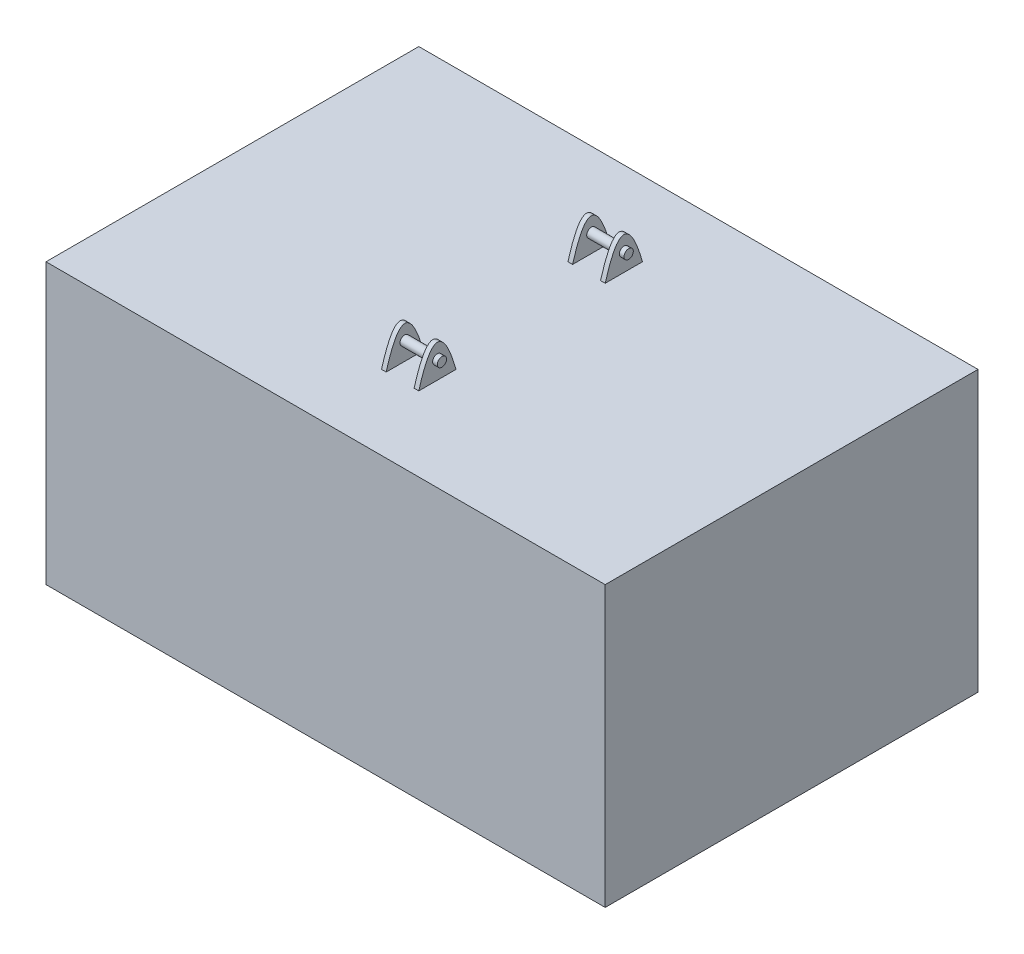
ISO-10303-21;
HEADER;
FILE_DESCRIPTION(('STEP AP214'),'2;1');
FILE_NAME('part.step','',(''),(''),'','','');
FILE_SCHEMA(('AUTOMOTIVE_DESIGN { 1 0 10303 214 1 1 1 1 }'));
ENDSEC;
DATA;
#1=APPLICATION_CONTEXT('core data for automotive mechanical design processes');
#2=APPLICATION_PROTOCOL_DEFINITION('international standard','automotive_design',2000,#1);
#3=PRODUCT_CONTEXT('',#1,'mechanical');
#4=PRODUCT('Part','Part','',(#3));
#5=PRODUCT_RELATED_PRODUCT_CATEGORY('part','',(#4));
#6=PRODUCT_DEFINITION_FORMATION('','',#4);
#7=PRODUCT_DEFINITION_CONTEXT('part definition',#1,'design');
#8=PRODUCT_DEFINITION('design','',#6,#7);
#9=PRODUCT_DEFINITION_SHAPE('','',#8);
#10=(LENGTH_UNIT() NAMED_UNIT(*) SI_UNIT(.MILLI.,.METRE.));
#11=(NAMED_UNIT(*) PLANE_ANGLE_UNIT() SI_UNIT($,.RADIAN.));
#12=(NAMED_UNIT(*) SI_UNIT($,.STERADIAN.) SOLID_ANGLE_UNIT());
#13=UNCERTAINTY_MEASURE_WITH_UNIT(LENGTH_MEASURE(1.E-05),#10,'distance_accuracy_value','');
#14=(GEOMETRIC_REPRESENTATION_CONTEXT(3) GLOBAL_UNCERTAINTY_ASSIGNED_CONTEXT((#13)) GLOBAL_UNIT_ASSIGNED_CONTEXT((#10,
#11,#12)) REPRESENTATION_CONTEXT('',''));
#15=CARTESIAN_POINT('',(0.,0.,0.));
#16=DIRECTION('',(0.,0.,1.));
#17=DIRECTION('',(1.,0.,0.));
#18=AXIS2_PLACEMENT_3D('',#15,#16,#17);
#19=CARTESIAN_POINT('',(-300.,150.,200.));
#20=DIRECTION('',(0.,1.,0.));
#21=DIRECTION('',(0.,0.,1.));
#22=AXIS2_PLACEMENT_3D('',#19,#20,#21);
#23=PLANE('',#22);
#24=DIRECTION('',(1.,0.,0.));
#25=VECTOR('',#24,1.);
#26=CARTESIAN_POINT('',(15.,150.,-80.));
#27=LINE('',#26,#25);
#28=CARTESIAN_POINT('',(15.,150.,-80.));
#29=VERTEX_POINT('',#28);
#30=CARTESIAN_POINT('',(20.,150.,-80.));
#31=VERTEX_POINT('',#30);
#32=EDGE_CURVE('E299',#29,#31,#27,.T.);
#33=ORIENTED_EDGE('',*,*,#32,.F.);
#34=DIRECTION('',(0.,0.,1.));
#35=VECTOR('',#34,1.);
#36=CARTESIAN_POINT('',(15.,150.,-80.));
#37=LINE('',#36,#35);
#38=CARTESIAN_POINT('',(15.,150.,-120.));
#39=VERTEX_POINT('',#38);
#40=EDGE_CURVE('E169',#39,#29,#37,.T.);
#41=ORIENTED_EDGE('',*,*,#40,.F.);
#42=DIRECTION('',(1.,0.,0.));
#43=VECTOR('',#42,1.);
#44=CARTESIAN_POINT('',(15.,150.,-120.));
#45=LINE('',#44,#43);
#46=CARTESIAN_POINT('',(20.,150.,-120.));
#47=VERTEX_POINT('',#46);
#48=EDGE_CURVE('E324',#39,#47,#45,.T.);
#49=ORIENTED_EDGE('',*,*,#48,.T.);
#50=DIRECTION('',(0.,0.,1.));
#51=VECTOR('',#50,1.);
#52=CARTESIAN_POINT('',(20.,150.,-100.));
#53=LINE('',#52,#51);
#54=EDGE_CURVE('E170',#47,#31,#53,.T.);
#55=ORIENTED_EDGE('',*,*,#54,.T.);
#56=EDGE_LOOP('',(#33,#41,#49,#55));
#57=FACE_BOUND('',#56,.T.);
#58=DIRECTION('',(1.,0.,0.));
#59=VECTOR('',#58,1.);
#60=CARTESIAN_POINT('',(15.,150.,120.));
#61=LINE('',#60,#59);
#62=CARTESIAN_POINT('',(15.,150.,120.));
#63=VERTEX_POINT('',#62);
#64=CARTESIAN_POINT('',(20.,150.,120.));
#65=VERTEX_POINT('',#64);
#66=EDGE_CURVE('E303',#63,#65,#61,.T.);
#67=ORIENTED_EDGE('',*,*,#66,.F.);
#68=DIRECTION('',(0.,0.,-1.));
#69=VECTOR('',#68,1.);
#70=CARTESIAN_POINT('',(15.,150.,100.));
#71=LINE('',#70,#69);
#72=CARTESIAN_POINT('',(15.,150.,80.));
#73=VERTEX_POINT('',#72);
#74=EDGE_CURVE('E260',#63,#73,#71,.T.);
#75=ORIENTED_EDGE('',*,*,#74,.T.);
#76=DIRECTION('',(1.,0.,0.));
#77=VECTOR('',#76,1.);
#78=CARTESIAN_POINT('',(15.,150.,80.));
#79=LINE('',#78,#77);
#80=CARTESIAN_POINT('',(20.,150.,80.));
#81=VERTEX_POINT('',#80);
#82=EDGE_CURVE('E610',#73,#81,#79,.T.);
#83=ORIENTED_EDGE('',*,*,#82,.T.);
#84=DIRECTION('',(0.,0.,-1.));
#85=VECTOR('',#84,1.);
#86=CARTESIAN_POINT('',(20.,150.,80.));
#87=LINE('',#86,#85);
#88=EDGE_CURVE('E261',#65,#81,#87,.T.);
#89=ORIENTED_EDGE('',*,*,#88,.F.);
#90=EDGE_LOOP('',(#67,#75,#83,#89));
#91=FACE_BOUND('',#90,.T.);
#92=DIRECTION('',(1.,0.,0.));
#93=VECTOR('',#92,1.);
#94=CARTESIAN_POINT('',(-300.,150.,200.));
#95=LINE('',#94,#93);
#96=CARTESIAN_POINT('',(-300.,150.,200.));
#97=VERTEX_POINT('',#96);
#98=CARTESIAN_POINT('',(300.,150.,200.));
#99=VERTEX_POINT('',#98);
#100=EDGE_CURVE('E308',#97,#99,#95,.T.);
#101=ORIENTED_EDGE('',*,*,#100,.T.);
#102=DIRECTION('',(0.,0.,1.));
#103=VECTOR('',#102,1.);
#104=CARTESIAN_POINT('',(300.,150.,200.));
#105=LINE('',#104,#103);
#106=CARTESIAN_POINT('',(300.,150.,-200.));
#107=VERTEX_POINT('',#106);
#108=EDGE_CURVE('E620',#107,#99,#105,.T.);
#109=ORIENTED_EDGE('',*,*,#108,.F.);
#110=DIRECTION('',(1.,0.,0.));
#111=VECTOR('',#110,1.);
#112=CARTESIAN_POINT('',(-300.,150.,-200.));
#113=LINE('',#112,#111);
#114=CARTESIAN_POINT('',(-300.,150.,-200.));
#115=VERTEX_POINT('',#114);
#116=EDGE_CURVE('E625',#115,#107,#113,.T.);
#117=ORIENTED_EDGE('',*,*,#116,.F.);
#118=DIRECTION('',(0.,0.,1.));
#119=VECTOR('',#118,1.);
#120=CARTESIAN_POINT('',(-300.,150.,200.));
#121=LINE('',#120,#119);
#122=EDGE_CURVE('E632',#115,#97,#121,.T.);
#123=ORIENTED_EDGE('',*,*,#122,.T.);
#124=EDGE_LOOP('',(#101,#109,#117,#123));
#125=FACE_BOUND('',#124,.T.);
#126=DIRECTION('',(-1.,0.,0.));
#127=VECTOR('',#126,1.);
#128=CARTESIAN_POINT('',(-15.,150.,80.));
#129=LINE('',#128,#127);
#130=CARTESIAN_POINT('',(-15.,150.,80.));
#131=VERTEX_POINT('',#130);
#132=CARTESIAN_POINT('',(-20.,150.,80.));
#133=VERTEX_POINT('',#132);
#134=EDGE_CURVE('E225',#131,#133,#129,.T.);
#135=ORIENTED_EDGE('',*,*,#134,.F.);
#136=DIRECTION('',(0.,0.,-1.));
#137=VECTOR('',#136,1.);
#138=CARTESIAN_POINT('',(-15.,150.,80.));
#139=LINE('',#138,#137);
#140=CARTESIAN_POINT('',(-15.,150.,120.));
#141=VERTEX_POINT('',#140);
#142=EDGE_CURVE('E216',#141,#131,#139,.T.);
#143=ORIENTED_EDGE('',*,*,#142,.F.);
#144=DIRECTION('',(-1.,0.,0.));
#145=VECTOR('',#144,1.);
#146=CARTESIAN_POINT('',(-15.,150.,120.));
#147=LINE('',#146,#145);
#148=CARTESIAN_POINT('',(-20.,150.,120.));
#149=VERTEX_POINT('',#148);
#150=EDGE_CURVE('E238',#141,#149,#147,.T.);
#151=ORIENTED_EDGE('',*,*,#150,.T.);
#152=DIRECTION('',(0.,0.,-1.));
#153=VECTOR('',#152,1.);
#154=CARTESIAN_POINT('',(-20.,150.,100.));
#155=LINE('',#154,#153);
#156=EDGE_CURVE('E217',#149,#133,#155,.T.);
#157=ORIENTED_EDGE('',*,*,#156,.T.);
#158=EDGE_LOOP('',(#135,#143,#151,#157));
#159=FACE_BOUND('',#158,.T.);
#160=DIRECTION('',(-1.,0.,0.));
#161=VECTOR('',#160,1.);
#162=CARTESIAN_POINT('',(-15.,150.,-120.));
#163=LINE('',#162,#161);
#164=CARTESIAN_POINT('',(-15.,150.,-120.));
#165=VERTEX_POINT('',#164);
#166=CARTESIAN_POINT('',(-20.,150.,-120.));
#167=VERTEX_POINT('',#166);
#168=EDGE_CURVE('E59',#165,#167,#163,.T.);
#169=ORIENTED_EDGE('',*,*,#168,.F.);
#170=DIRECTION('',(0.,0.,1.));
#171=VECTOR('',#170,1.);
#172=CARTESIAN_POINT('',(-15.,150.,-100.));
#173=LINE('',#172,#171);
#174=CARTESIAN_POINT('',(-15.,150.,-80.));
#175=VERTEX_POINT('',#174);
#176=EDGE_CURVE('E54',#165,#175,#173,.T.);
#177=ORIENTED_EDGE('',*,*,#176,.T.);
#178=DIRECTION('',(-1.,0.,0.));
#179=VECTOR('',#178,1.);
#180=CARTESIAN_POINT('',(-15.,150.,-80.));
#181=LINE('',#180,#179);
#182=CARTESIAN_POINT('',(-20.,150.,-80.));
#183=VERTEX_POINT('',#182);
#184=EDGE_CURVE('E123',#175,#183,#181,.T.);
#185=ORIENTED_EDGE('',*,*,#184,.T.);
#186=DIRECTION('',(0.,0.,1.));
#187=VECTOR('',#186,1.);
#188=CARTESIAN_POINT('',(-20.,150.,-80.));
#189=LINE('',#188,#187);
#190=EDGE_CURVE('E126',#167,#183,#189,.T.);
#191=ORIENTED_EDGE('',*,*,#190,.F.);
#192=EDGE_LOOP('',(#169,#177,#185,#191));
#193=FACE_BOUND('',#192,.T.);
#194=ADVANCED_FACE('F38',(#57,#91,#125,#159,#193),#23,.T.);
#195=CARTESIAN_POINT('',(15.,185.184791542919,-100.));
#196=DIRECTION('',(1.,0.,0.));
#197=DIRECTION('',(0.,0.,1.));
#198=AXIS2_PLACEMENT_3D('',#195,#196,#197);
#199=PLANE('',#198);
#200=CARTESIAN_POINT('',(15.,150.,-80.));
#201=CARTESIAN_POINT('',(15.,220.369583085838,-100.));
#202=CARTESIAN_POINT('',(15.,150.,-120.));
#203=B_SPLINE_CURVE_WITH_KNOTS('',2,(#200,#201,#202),.UNSPECIFIED.,.F.,.F.,(3,3),(0.,1.),.UNSPECIFIED.);
#204=EDGE_CURVE('E162',#29,#39,#203,.T.);
#205=ORIENTED_EDGE('',*,*,#204,.T.);
#206=ORIENTED_EDGE('',*,*,#40,.T.);
#207=EDGE_LOOP('',(#205,#206));
#208=FACE_BOUND('',#207,.T.);
#209=CARTESIAN_POINT('',(15.,169.588362032982,-100.167931578479));
#210=DIRECTION('',(1.,0.,0.));
#211=DIRECTION('',(0.,0.,-1.));
#212=AXIS2_PLACEMENT_3D('',#209,#210,#211);
#213=CIRCLE('',#212,5.00000000000001);
#214=CARTESIAN_POINT('',(15.,169.588362032982,-105.167931578479));
#215=VERTEX_POINT('',#214);
#216=EDGE_CURVE('E47',#215,#215,#213,.F.);
#217=ORIENTED_EDGE('',*,*,#216,.F.);
#218=EDGE_LOOP('',(#217));
#219=FACE_BOUND('',#218,.T.);
#220=ADVANCED_FACE('F291',(#208,#219),#199,.F.);
#221=CARTESIAN_POINT('',(20.,185.184791542919,-100.));
#222=DIRECTION('',(1.,0.,0.));
#223=DIRECTION('',(0.,0.,1.));
#224=AXIS2_PLACEMENT_3D('',#221,#222,#223);
#225=PLANE('',#224);
#226=CARTESIAN_POINT('',(20.,150.,-80.));
#227=CARTESIAN_POINT('',(20.,220.369583085838,-100.));
#228=CARTESIAN_POINT('',(20.,150.,-120.));
#229=B_SPLINE_CURVE_WITH_KNOTS('',2,(#226,#227,#228),.UNSPECIFIED.,.F.,.F.,(3,3),(0.,1.),.UNSPECIFIED.);
#230=EDGE_CURVE('E330',#31,#47,#229,.T.);
#231=ORIENTED_EDGE('',*,*,#230,.F.);
#232=ORIENTED_EDGE('',*,*,#54,.F.);
#233=EDGE_LOOP('',(#231,#232));
#234=FACE_BOUND('',#233,.T.);
#235=CARTESIAN_POINT('',(20.,169.588362032982,-100.167931578479));
#236=DIRECTION('',(1.,0.,0.));
#237=DIRECTION('',(0.,0.,-1.));
#238=AXIS2_PLACEMENT_3D('',#235,#236,#237);
#239=CIRCLE('',#238,5.00000000000001);
#240=CARTESIAN_POINT('',(20.,169.588362032982,-105.167931578479));
#241=VERTEX_POINT('',#240);
#242=EDGE_CURVE('E157',#241,#241,#239,.F.);
#243=ORIENTED_EDGE('',*,*,#242,.T.);
#244=EDGE_LOOP('',(#243));
#245=FACE_BOUND('',#244,.T.);
#246=ADVANCED_FACE('F183',(#234,#245),#225,.T.);
#247=CARTESIAN_POINT('',(-15.,185.184791542919,100.));
#248=DIRECTION('',(-1.,0.,0.));
#249=DIRECTION('',(0.,0.,-1.));
#250=AXIS2_PLACEMENT_3D('',#247,#248,#249);
#251=PLANE('',#250);
#252=CARTESIAN_POINT('',(-15.,150.,80.));
#253=CARTESIAN_POINT('',(-15.,220.369583085838,100.));
#254=CARTESIAN_POINT('',(-15.,150.,120.));
#255=B_SPLINE_CURVE_WITH_KNOTS('',2,(#252,#253,#254),.UNSPECIFIED.,.F.,.F.,(3,3),(0.,1.),.UNSPECIFIED.);
#256=EDGE_CURVE('E208',#131,#141,#255,.T.);
#257=ORIENTED_EDGE('',*,*,#256,.T.);
#258=ORIENTED_EDGE('',*,*,#142,.T.);
#259=EDGE_LOOP('',(#257,#258));
#260=FACE_BOUND('',#259,.T.);
#261=CARTESIAN_POINT('',(-15.,169.588362032982,100.167931578479));
#262=DIRECTION('',(-1.,0.,0.));
#263=DIRECTION('',(0.,0.,1.));
#264=AXIS2_PLACEMENT_3D('',#261,#262,#263);
#265=CIRCLE('',#264,5.00000000000001);
#266=CARTESIAN_POINT('',(-15.,169.588362032982,105.167931578479));
#267=VERTEX_POINT('',#266);
#268=EDGE_CURVE('E161',#267,#267,#265,.F.);
#269=ORIENTED_EDGE('',*,*,#268,.F.);
#270=EDGE_LOOP('',(#269));
#271=FACE_BOUND('',#270,.T.);
#272=ADVANCED_FACE('F193',(#260,#271),#251,.F.);
#273=CARTESIAN_POINT('',(-20.,185.184791542919,100.));
#274=DIRECTION('',(-1.,0.,0.));
#275=DIRECTION('',(0.,0.,-1.));
#276=AXIS2_PLACEMENT_3D('',#273,#274,#275);
#277=PLANE('',#276);
#278=CARTESIAN_POINT('',(-20.,150.,80.));
#279=CARTESIAN_POINT('',(-20.,220.369583085838,100.));
#280=CARTESIAN_POINT('',(-20.,150.,120.));
#281=B_SPLINE_CURVE_WITH_KNOTS('',2,(#278,#279,#280),.UNSPECIFIED.,.F.,.F.,(3,3),(0.,1.),.UNSPECIFIED.);
#282=EDGE_CURVE('E226',#133,#149,#281,.T.);
#283=ORIENTED_EDGE('',*,*,#282,.F.);
#284=ORIENTED_EDGE('',*,*,#156,.F.);
#285=EDGE_LOOP('',(#283,#284));
#286=FACE_BOUND('',#285,.T.);
#287=CARTESIAN_POINT('',(-20.,169.588362032982,100.167931578479));
#288=DIRECTION('',(-1.,0.,0.));
#289=DIRECTION('',(0.,0.,1.));
#290=AXIS2_PLACEMENT_3D('',#287,#288,#289);
#291=CIRCLE('',#290,5.00000000000001);
#292=CARTESIAN_POINT('',(-20.,169.588362032982,105.167931578479));
#293=VERTEX_POINT('',#292);
#294=EDGE_CURVE('E232',#293,#293,#291,.F.);
#295=ORIENTED_EDGE('',*,*,#294,.T.);
#296=EDGE_LOOP('',(#295));
#297=FACE_BOUND('',#296,.T.);
#298=ADVANCED_FACE('F196',(#286,#297),#277,.T.);
#299=CARTESIAN_POINT('',(-300.,150.,-200.));
#300=DIRECTION('',(0.,0.,-1.));
#301=DIRECTION('',(0.,1.,0.));
#302=AXIS2_PLACEMENT_3D('',#299,#300,#301);
#303=PLANE('',#302);
#304=ORIENTED_EDGE('',*,*,#116,.T.);
#305=DIRECTION('',(0.,1.,0.));
#306=VECTOR('',#305,1.);
#307=CARTESIAN_POINT('',(300.,150.,-200.));
#308=LINE('',#307,#306);
#309=CARTESIAN_POINT('',(300.,-150.,-200.));
#310=VERTEX_POINT('',#309);
#311=EDGE_CURVE('E618',#310,#107,#308,.T.);
#312=ORIENTED_EDGE('',*,*,#311,.F.);
#313=DIRECTION('',(1.,0.,0.));
#314=VECTOR('',#313,1.);
#315=CARTESIAN_POINT('',(-300.,-150.,-200.));
#316=LINE('',#315,#314);
#317=CARTESIAN_POINT('',(-300.,-150.,-200.));
#318=VERTEX_POINT('',#317);
#319=EDGE_CURVE('E636',#318,#310,#316,.T.);
#320=ORIENTED_EDGE('',*,*,#319,.F.);
#321=DIRECTION('',(0.,1.,0.));
#322=VECTOR('',#321,1.);
#323=CARTESIAN_POINT('',(-300.,150.,-200.));
#324=LINE('',#323,#322);
#325=EDGE_CURVE('E648',#318,#115,#324,.T.);
#326=ORIENTED_EDGE('',*,*,#325,.T.);
#327=EDGE_LOOP('',(#304,#312,#320,#326));
#328=FACE_BOUND('',#327,.T.);
#329=ADVANCED_FACE('F40',(#328),#303,.T.);
#330=CARTESIAN_POINT('',(-300.,-150.,200.));
#331=DIRECTION('',(0.,-1.,0.));
#332=DIRECTION('',(0.,0.,-1.));
#333=AXIS2_PLACEMENT_3D('',#330,#331,#332);
#334=PLANE('',#333);
#335=ORIENTED_EDGE('',*,*,#319,.T.);
#336=DIRECTION('',(0.,0.,-1.));
#337=VECTOR('',#336,1.);
#338=CARTESIAN_POINT('',(300.,-150.,200.));
#339=LINE('',#338,#337);
#340=CARTESIAN_POINT('',(300.,-150.,200.));
#341=VERTEX_POINT('',#340);
#342=EDGE_CURVE('E651',#341,#310,#339,.T.);
#343=ORIENTED_EDGE('',*,*,#342,.F.);
#344=DIRECTION('',(1.,0.,0.));
#345=VECTOR('',#344,1.);
#346=CARTESIAN_POINT('',(-300.,-150.,200.));
#347=LINE('',#346,#345);
#348=CARTESIAN_POINT('',(-300.,-150.,200.));
#349=VERTEX_POINT('',#348);
#350=EDGE_CURVE('E639',#349,#341,#347,.T.);
#351=ORIENTED_EDGE('',*,*,#350,.F.);
#352=DIRECTION('',(0.,0.,-1.));
#353=VECTOR('',#352,1.);
#354=CARTESIAN_POINT('',(-300.,-150.,200.));
#355=LINE('',#354,#353);
#356=EDGE_CURVE('E623',#349,#318,#355,.T.);
#357=ORIENTED_EDGE('',*,*,#356,.T.);
#358=EDGE_LOOP('',(#335,#343,#351,#357));
#359=FACE_BOUND('',#358,.T.);
#360=ADVANCED_FACE('F284',(#359),#334,.T.);
#361=CARTESIAN_POINT('',(-300.,150.,200.));
#362=DIRECTION('',(0.,0.,1.));
#363=DIRECTION('',(0.,-1.,0.));
#364=AXIS2_PLACEMENT_3D('',#361,#362,#363);
#365=PLANE('',#364);
#366=ORIENTED_EDGE('',*,*,#350,.T.);
#367=DIRECTION('',(0.,-1.,0.));
#368=VECTOR('',#367,1.);
#369=CARTESIAN_POINT('',(300.,150.,200.));
#370=LINE('',#369,#368);
#371=EDGE_CURVE('E606',#99,#341,#370,.T.);
#372=ORIENTED_EDGE('',*,*,#371,.F.);
#373=ORIENTED_EDGE('',*,*,#100,.F.);
#374=DIRECTION('',(0.,-1.,0.));
#375=VECTOR('',#374,1.);
#376=CARTESIAN_POINT('',(-300.,150.,200.));
#377=LINE('',#376,#375);
#378=EDGE_CURVE('E626',#97,#349,#377,.T.);
#379=ORIENTED_EDGE('',*,*,#378,.T.);
#380=EDGE_LOOP('',(#366,#372,#373,#379));
#381=FACE_BOUND('',#380,.T.);
#382=ADVANCED_FACE('F282',(#381),#365,.T.);
#383=CARTESIAN_POINT('',(-300.,0.,0.));
#384=DIRECTION('',(1.,0.,0.));
#385=DIRECTION('',(0.,0.,-1.));
#386=AXIS2_PLACEMENT_3D('',#383,#384,#385);
#387=PLANE('',#386);
#388=ORIENTED_EDGE('',*,*,#325,.F.);
#389=ORIENTED_EDGE('',*,*,#356,.F.);
#390=ORIENTED_EDGE('',*,*,#378,.F.);
#391=ORIENTED_EDGE('',*,*,#122,.F.);
#392=EDGE_LOOP('',(#388,#389,#390,#391));
#393=FACE_BOUND('',#392,.T.);
#394=ADVANCED_FACE('F278',(#393),#387,.F.);
#395=CARTESIAN_POINT('',(300.,0.,0.));
#396=DIRECTION('',(1.,0.,0.));
#397=DIRECTION('',(0.,0.,-1.));
#398=AXIS2_PLACEMENT_3D('',#395,#396,#397);
#399=PLANE('',#398);
#400=ORIENTED_EDGE('',*,*,#311,.T.);
#401=ORIENTED_EDGE('',*,*,#108,.T.);
#402=ORIENTED_EDGE('',*,*,#371,.T.);
#403=ORIENTED_EDGE('',*,*,#342,.T.);
#404=EDGE_LOOP('',(#400,#401,#402,#403));
#405=FACE_BOUND('',#404,.T.);
#406=ADVANCED_FACE('F272',(#405),#399,.T.);
#407=CARTESIAN_POINT('',(15.,150.,80.));
#408=CARTESIAN_POINT('',(15.,220.369583085838,100.));
#409=CARTESIAN_POINT('',(15.,150.,120.));
#410=B_SPLINE_CURVE_WITH_KNOTS('',2,(#407,#408,#409),.UNSPECIFIED.,.F.,.F.,(3,3),(0.,1.),.UNSPECIFIED.);
#411=DIRECTION('',(1.,0.,0.));
#412=VECTOR('',#411,1.);
#413=SURFACE_OF_LINEAR_EXTRUSION('',#410,#412);
#414=CARTESIAN_POINT('',(20.,150.,80.));
#415=CARTESIAN_POINT('',(20.,220.369583085838,100.));
#416=CARTESIAN_POINT('',(20.,150.,120.));
#417=B_SPLINE_CURVE_WITH_KNOTS('',2,(#414,#415,#416),.UNSPECIFIED.,.F.,.F.,(3,3),(0.,1.),.UNSPECIFIED.);
#418=EDGE_CURVE('E252',#81,#65,#417,.T.);
#419=ORIENTED_EDGE('',*,*,#418,.F.);
#420=ORIENTED_EDGE('',*,*,#82,.F.);
#421=EDGE_CURVE('E253',#73,#63,#410,.T.);
#422=ORIENTED_EDGE('',*,*,#421,.T.);
#423=ORIENTED_EDGE('',*,*,#66,.T.);
#424=EDGE_LOOP('',(#419,#420,#422,#423));
#425=FACE_BOUND('',#424,.T.);
#426=ADVANCED_FACE('F267',(#425),#413,.T.);
#427=CARTESIAN_POINT('',(15.,185.184791542919,100.));
#428=DIRECTION('',(1.,0.,0.));
#429=DIRECTION('',(0.,0.,-1.));
#430=AXIS2_PLACEMENT_3D('',#427,#428,#429);
#431=PLANE('',#430);
#432=CARTESIAN_POINT('',(15.,169.588362032982,100.167931578479));
#433=DIRECTION('',(1.,0.,0.));
#434=DIRECTION('',(0.,0.,-1.));
#435=AXIS2_PLACEMENT_3D('',#432,#433,#434);
#436=CIRCLE('',#435,5.00000000000001);
#437=CARTESIAN_POINT('',(15.,169.588362032982,95.1679315784785));
#438=VERTEX_POINT('',#437);
#439=EDGE_CURVE('E248',#438,#438,#436,.T.);
#440=ORIENTED_EDGE('',*,*,#439,.T.);
#441=EDGE_LOOP('',(#440));
#442=FACE_BOUND('',#441,.T.);
#443=ORIENTED_EDGE('',*,*,#421,.F.);
#444=ORIENTED_EDGE('',*,*,#74,.F.);
#445=EDGE_LOOP('',(#443,#444));
#446=FACE_BOUND('',#445,.T.);
#447=ADVANCED_FACE('F271',(#442,#446),#431,.F.);
#448=CARTESIAN_POINT('',(20.,185.184791542919,100.));
#449=DIRECTION('',(1.,0.,0.));
#450=DIRECTION('',(0.,0.,-1.));
#451=AXIS2_PLACEMENT_3D('',#448,#449,#450);
#452=PLANE('',#451);
#453=CARTESIAN_POINT('',(20.,169.588362032982,100.167931578479));
#454=DIRECTION('',(1.,0.,0.));
#455=DIRECTION('',(0.,0.,-1.));
#456=AXIS2_PLACEMENT_3D('',#453,#454,#455);
#457=CIRCLE('',#456,5.00000000000001);
#458=CARTESIAN_POINT('',(20.,169.588362032982,95.1679315784785));
#459=VERTEX_POINT('',#458);
#460=EDGE_CURVE('E326',#459,#459,#457,.T.);
#461=ORIENTED_EDGE('',*,*,#460,.F.);
#462=EDGE_LOOP('',(#461));
#463=FACE_BOUND('',#462,.T.);
#464=ORIENTED_EDGE('',*,*,#418,.T.);
#465=ORIENTED_EDGE('',*,*,#88,.T.);
#466=EDGE_LOOP('',(#464,#465));
#467=FACE_BOUND('',#466,.T.);
#468=ADVANCED_FACE('F274',(#463,#467),#452,.T.);
#469=CARTESIAN_POINT('',(25.,169.588362032982,100.167931578479));
#470=DIRECTION('',(1.,0.,0.));
#471=DIRECTION('',(0.,0.,-1.));
#472=AXIS2_PLACEMENT_3D('',#469,#470,#471);
#473=PLANE('',#472);
#474=CARTESIAN_POINT('',(25.,169.588362032982,100.167931578479));
#475=DIRECTION('',(1.,0.,0.));
#476=DIRECTION('',(0.,0.,-1.));
#477=AXIS2_PLACEMENT_3D('',#474,#475,#476);
#478=CIRCLE('',#477,5.00000000000001);
#479=CARTESIAN_POINT('',(25.,169.588362032982,95.1679315784785));
#480=VERTEX_POINT('',#479);
#481=EDGE_CURVE('E241',#480,#480,#478,.T.);
#482=ORIENTED_EDGE('',*,*,#481,.T.);
#483=EDGE_LOOP('',(#482));
#484=FACE_BOUND('',#483,.T.);
#485=ADVANCED_FACE('F206',(#484),#473,.T.);
#486=CARTESIAN_POINT('',(0.,169.588362032982,100.167931578479));
#487=DIRECTION('',(1.,0.,0.));
#488=DIRECTION('',(0.,0.,-1.));
#489=AXIS2_PLACEMENT_3D('',#486,#487,#488);
#490=CYLINDRICAL_SURFACE('',#489,5.00000000000001);
#491=ORIENTED_EDGE('',*,*,#460,.T.);
#492=EDGE_LOOP('',(#491));
#493=FACE_BOUND('',#492,.T.);
#494=ORIENTED_EDGE('',*,*,#481,.F.);
#495=EDGE_LOOP('',(#494));
#496=FACE_BOUND('',#495,.T.);
#497=ADVANCED_FACE('F399',(#493,#496),#490,.T.);
#498=ORIENTED_EDGE('',*,*,#439,.F.);
#499=EDGE_LOOP('',(#498));
#500=FACE_BOUND('',#499,.T.);
#501=ORIENTED_EDGE('',*,*,#268,.T.);
#502=EDGE_LOOP('',(#501));
#503=FACE_BOUND('',#502,.T.);
#504=ADVANCED_FACE('F204',(#500,#503),#490,.T.);
#505=DIRECTION('',(-1.,0.,0.));
#506=VECTOR('',#505,1.);
#507=SURFACE_OF_LINEAR_EXTRUSION('',#255,#506);
#508=ORIENTED_EDGE('',*,*,#282,.T.);
#509=ORIENTED_EDGE('',*,*,#150,.F.);
#510=ORIENTED_EDGE('',*,*,#256,.F.);
#511=ORIENTED_EDGE('',*,*,#134,.T.);
#512=EDGE_LOOP('',(#508,#509,#510,#511));
#513=FACE_BOUND('',#512,.T.);
#514=ADVANCED_FACE('F188',(#513),#507,.F.);
#515=CARTESIAN_POINT('',(-25.,169.588362032982,100.167931578479));
#516=DIRECTION('',(-1.,0.,0.));
#517=DIRECTION('',(0.,0.,-1.));
#518=AXIS2_PLACEMENT_3D('',#515,#516,#517);
#519=PLANE('',#518);
#520=CARTESIAN_POINT('',(-25.,169.588362032982,100.167931578479));
#521=DIRECTION('',(1.,0.,0.));
#522=DIRECTION('',(0.,0.,-1.));
#523=AXIS2_PLACEMENT_3D('',#520,#521,#522);
#524=CIRCLE('',#523,5.00000000000001);
#525=CARTESIAN_POINT('',(-25.,169.588362032982,95.1679315784785));
#526=VERTEX_POINT('',#525);
#527=EDGE_CURVE('E319',#526,#526,#524,.T.);
#528=ORIENTED_EDGE('',*,*,#527,.F.);
#529=EDGE_LOOP('',(#528));
#530=FACE_BOUND('',#529,.T.);
#531=ADVANCED_FACE('F185',(#530),#519,.T.);
#532=CARTESIAN_POINT('',(0.,169.588362032982,100.167931578479));
#533=DIRECTION('',(-1.,0.,0.));
#534=DIRECTION('',(0.,0.,1.));
#535=AXIS2_PLACEMENT_3D('',#532,#533,#534);
#536=CYLINDRICAL_SURFACE('',#535,5.00000000000001);
#537=ORIENTED_EDGE('',*,*,#294,.F.);
#538=EDGE_LOOP('',(#537));
#539=FACE_BOUND('',#538,.T.);
#540=ORIENTED_EDGE('',*,*,#527,.T.);
#541=EDGE_LOOP('',(#540));
#542=FACE_BOUND('',#541,.T.);
#543=ADVANCED_FACE('F181',(#539,#542),#536,.T.);
#544=DIRECTION('',(1.,0.,0.));
#545=VECTOR('',#544,1.);
#546=SURFACE_OF_LINEAR_EXTRUSION('',#203,#545);
#547=ORIENTED_EDGE('',*,*,#230,.T.);
#548=ORIENTED_EDGE('',*,*,#48,.F.);
#549=ORIENTED_EDGE('',*,*,#204,.F.);
#550=ORIENTED_EDGE('',*,*,#32,.T.);
#551=EDGE_LOOP('',(#547,#548,#549,#550));
#552=FACE_BOUND('',#551,.T.);
#553=ADVANCED_FACE('F176',(#552),#546,.F.);
#554=CARTESIAN_POINT('',(25.,169.588362032982,-100.167931578479));
#555=DIRECTION('',(1.,0.,0.));
#556=DIRECTION('',(0.,0.,1.));
#557=AXIS2_PLACEMENT_3D('',#554,#555,#556);
#558=PLANE('',#557);
#559=CARTESIAN_POINT('',(25.,169.588362032982,-100.167931578479));
#560=DIRECTION('',(-1.,0.,0.));
#561=DIRECTION('',(0.,0.,1.));
#562=AXIS2_PLACEMENT_3D('',#559,#560,#561);
#563=CIRCLE('',#562,5.00000000000001);
#564=CARTESIAN_POINT('',(25.,169.588362032982,-95.1679315784785));
#565=VERTEX_POINT('',#564);
#566=EDGE_CURVE('E131',#565,#565,#563,.T.);
#567=ORIENTED_EDGE('',*,*,#566,.F.);
#568=EDGE_LOOP('',(#567));
#569=FACE_BOUND('',#568,.T.);
#570=ADVANCED_FACE('F180',(#569),#558,.T.);
#571=CARTESIAN_POINT('',(0.,169.588362032982,-100.167931578479));
#572=DIRECTION('',(1.,0.,0.));
#573=DIRECTION('',(0.,0.,-1.));
#574=AXIS2_PLACEMENT_3D('',#571,#572,#573);
#575=CYLINDRICAL_SURFACE('',#574,5.00000000000001);
#576=ORIENTED_EDGE('',*,*,#242,.F.);
#577=EDGE_LOOP('',(#576));
#578=FACE_BOUND('',#577,.T.);
#579=ORIENTED_EDGE('',*,*,#566,.T.);
#580=EDGE_LOOP('',(#579));
#581=FACE_BOUND('',#580,.T.);
#582=ADVANCED_FACE('F427',(#578,#581),#575,.T.);
#583=ORIENTED_EDGE('',*,*,#216,.T.);
#584=EDGE_LOOP('',(#583));
#585=FACE_BOUND('',#584,.T.);
#586=CARTESIAN_POINT('',(-15.,169.588362032982,-100.167931578479));
#587=DIRECTION('',(-1.,0.,0.));
#588=DIRECTION('',(0.,0.,1.));
#589=AXIS2_PLACEMENT_3D('',#586,#587,#588);
#590=CIRCLE('',#589,5.00000000000001);
#591=CARTESIAN_POINT('',(-15.,169.588362032982,-95.1679315784785));
#592=VERTEX_POINT('',#591);
#593=EDGE_CURVE('E138',#592,#592,#590,.T.);
#594=ORIENTED_EDGE('',*,*,#593,.F.);
#595=EDGE_LOOP('',(#594));
#596=FACE_BOUND('',#595,.T.);
#597=ADVANCED_FACE('F434',(#585,#596),#575,.T.);
#598=CARTESIAN_POINT('',(-15.,150.,-80.));
#599=CARTESIAN_POINT('',(-15.,220.369583085838,-100.));
#600=CARTESIAN_POINT('',(-15.,150.,-120.));
#601=B_SPLINE_CURVE_WITH_KNOTS('',2,(#598,#599,#600),.UNSPECIFIED.,.F.,.F.,(3,3),(0.,1.),.UNSPECIFIED.);
#602=DIRECTION('',(-1.,0.,0.));
#603=VECTOR('',#602,1.);
#604=SURFACE_OF_LINEAR_EXTRUSION('',#601,#603);
#605=CARTESIAN_POINT('',(-20.,150.,-80.));
#606=CARTESIAN_POINT('',(-20.,220.369583085838,-100.));
#607=CARTESIAN_POINT('',(-20.,150.,-120.));
#608=B_SPLINE_CURVE_WITH_KNOTS('',2,(#605,#606,#607),.UNSPECIFIED.,.F.,.F.,(3,3),(0.,1.),.UNSPECIFIED.);
#609=EDGE_CURVE('E134',#183,#167,#608,.T.);
#610=ORIENTED_EDGE('',*,*,#609,.F.);
#611=ORIENTED_EDGE('',*,*,#184,.F.);
#612=EDGE_CURVE('E142',#175,#165,#601,.T.);
#613=ORIENTED_EDGE('',*,*,#612,.T.);
#614=ORIENTED_EDGE('',*,*,#168,.T.);
#615=EDGE_LOOP('',(#610,#611,#613,#614));
#616=FACE_BOUND('',#615,.T.);
#617=ADVANCED_FACE('F135',(#616),#604,.T.);
#618=CARTESIAN_POINT('',(-15.,185.184791542919,-100.));
#619=DIRECTION('',(-1.,0.,0.));
#620=DIRECTION('',(0.,0.,1.));
#621=AXIS2_PLACEMENT_3D('',#618,#619,#620);
#622=PLANE('',#621);
#623=ORIENTED_EDGE('',*,*,#593,.T.);
#624=EDGE_LOOP('',(#623));
#625=FACE_BOUND('',#624,.T.);
#626=ORIENTED_EDGE('',*,*,#612,.F.);
#627=ORIENTED_EDGE('',*,*,#176,.F.);
#628=EDGE_LOOP('',(#626,#627));
#629=FACE_BOUND('',#628,.T.);
#630=ADVANCED_FACE('F446',(#625,#629),#622,.F.);
#631=CARTESIAN_POINT('',(-20.,185.184791542919,-100.));
#632=DIRECTION('',(-1.,0.,0.));
#633=DIRECTION('',(0.,0.,1.));
#634=AXIS2_PLACEMENT_3D('',#631,#632,#633);
#635=PLANE('',#634);
#636=CARTESIAN_POINT('',(-20.,169.588362032982,-100.167931578479));
#637=DIRECTION('',(-1.,0.,0.));
#638=DIRECTION('',(0.,0.,1.));
#639=AXIS2_PLACEMENT_3D('',#636,#637,#638);
#640=CIRCLE('',#639,5.00000000000001);
#641=CARTESIAN_POINT('',(-20.,169.588362032982,-95.1679315784785));
#642=VERTEX_POINT('',#641);
#643=EDGE_CURVE('E11',#642,#642,#640,.T.);
#644=ORIENTED_EDGE('',*,*,#643,.F.);
#645=EDGE_LOOP('',(#644));
#646=FACE_BOUND('',#645,.T.);
#647=ORIENTED_EDGE('',*,*,#609,.T.);
#648=ORIENTED_EDGE('',*,*,#190,.T.);
#649=EDGE_LOOP('',(#647,#648));
#650=FACE_BOUND('',#649,.T.);
#651=ADVANCED_FACE('F140',(#646,#650),#635,.T.);
#652=CARTESIAN_POINT('',(-25.,169.588362032982,-100.167931578479));
#653=DIRECTION('',(-1.,0.,0.));
#654=DIRECTION('',(0.,0.,1.));
#655=AXIS2_PLACEMENT_3D('',#652,#653,#654);
#656=PLANE('',#655);
#657=CARTESIAN_POINT('',(-25.,169.588362032982,-100.167931578479));
#658=DIRECTION('',(-1.,0.,0.));
#659=DIRECTION('',(0.,0.,1.));
#660=AXIS2_PLACEMENT_3D('',#657,#658,#659);
#661=CIRCLE('',#660,5.00000000000001);
#662=CARTESIAN_POINT('',(-25.,169.588362032982,-95.1679315784785));
#663=VERTEX_POINT('',#662);
#664=EDGE_CURVE('E614',#663,#663,#661,.T.);
#665=ORIENTED_EDGE('',*,*,#664,.T.);
#666=EDGE_LOOP('',(#665));
#667=FACE_BOUND('',#666,.T.);
#668=ADVANCED_FACE('F458',(#667),#656,.T.);
#669=CARTESIAN_POINT('',(0.,169.588362032982,-100.167931578479));
#670=DIRECTION('',(-1.,0.,0.));
#671=DIRECTION('',(0.,0.,1.));
#672=AXIS2_PLACEMENT_3D('',#669,#670,#671);
#673=CYLINDRICAL_SURFACE('',#672,5.00000000000001);
#674=ORIENTED_EDGE('',*,*,#643,.T.);
#675=EDGE_LOOP('',(#674));
#676=FACE_BOUND('',#675,.T.);
#677=ORIENTED_EDGE('',*,*,#664,.F.);
#678=EDGE_LOOP('',(#677));
#679=FACE_BOUND('',#678,.T.);
#680=ADVANCED_FACE('F465',(#676,#679),#673,.T.);
#681=CLOSED_SHELL('',(#194,#220,#246,#272,#298,#329,#360,#382,#394,#406,#426,#447,#468,#485,
#497,#504,#514,#531,#543,#553,#570,#582,#597,#617,#630,#651,#668,#680));
#682=MANIFOLD_SOLID_BREP('B2',#681);
#683=ADVANCED_BREP_SHAPE_REPRESENTATION('',(#18,#682),#14);
#684=SHAPE_DEFINITION_REPRESENTATION(#9,#683);
ENDSEC;
END-ISO-10303-21;
